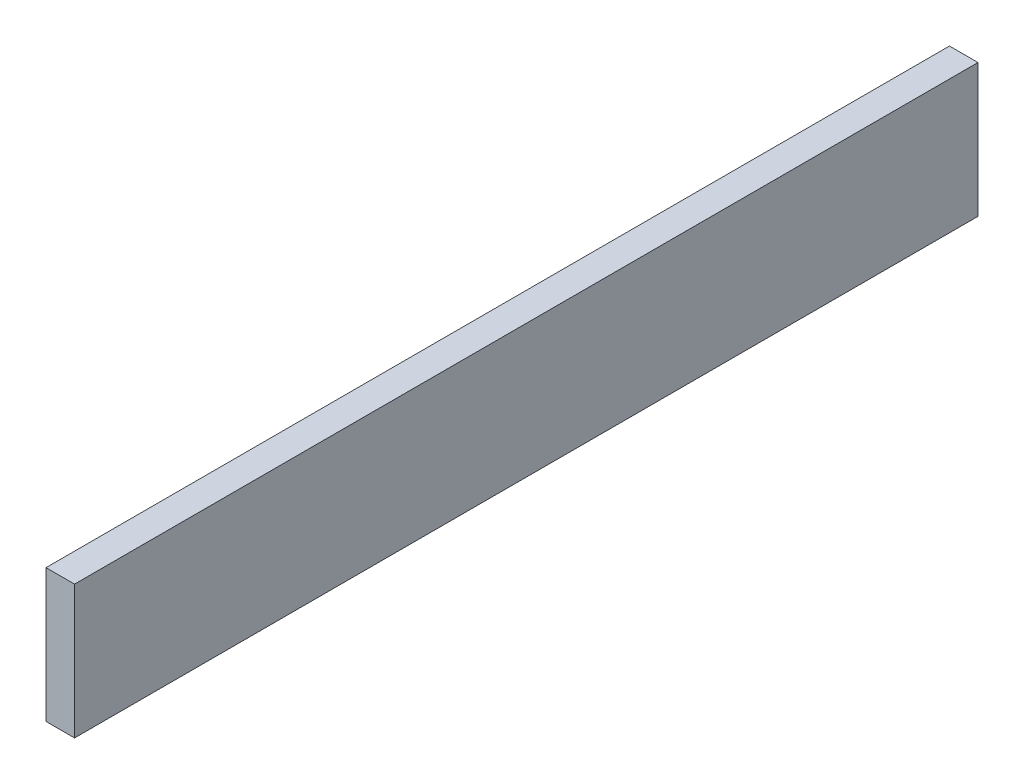
ISO-10303-21;
HEADER;
FILE_DESCRIPTION(('STEP AP214'),'2;1');
FILE_NAME('part.step','',(''),(''),'','','');
FILE_SCHEMA(('AUTOMOTIVE_DESIGN { 1 0 10303 214 1 1 1 1 }'));
ENDSEC;
DATA;
#1=APPLICATION_CONTEXT('core data for automotive mechanical design processes');
#2=APPLICATION_PROTOCOL_DEFINITION('international standard','automotive_design',2000,#1);
#3=PRODUCT_CONTEXT('',#1,'mechanical');
#4=PRODUCT('Part','Part','',(#3));
#5=PRODUCT_RELATED_PRODUCT_CATEGORY('part','',(#4));
#6=PRODUCT_DEFINITION_FORMATION('','',#4);
#7=PRODUCT_DEFINITION_CONTEXT('part definition',#1,'design');
#8=PRODUCT_DEFINITION('design','',#6,#7);
#9=PRODUCT_DEFINITION_SHAPE('','',#8);
#10=(LENGTH_UNIT() NAMED_UNIT(*) SI_UNIT(.MILLI.,.METRE.));
#11=(NAMED_UNIT(*) PLANE_ANGLE_UNIT() SI_UNIT($,.RADIAN.));
#12=(NAMED_UNIT(*) SI_UNIT($,.STERADIAN.) SOLID_ANGLE_UNIT());
#13=UNCERTAINTY_MEASURE_WITH_UNIT(LENGTH_MEASURE(1.E-05),#10,'distance_accuracy_value','');
#14=(GEOMETRIC_REPRESENTATION_CONTEXT(3) GLOBAL_UNCERTAINTY_ASSIGNED_CONTEXT((#13)) GLOBAL_UNIT_ASSIGNED_CONTEXT((#10,
#11,#12)) REPRESENTATION_CONTEXT('',''));
#15=CARTESIAN_POINT('',(0.,0.,0.));
#16=DIRECTION('',(0.,0.,1.));
#17=DIRECTION('',(1.,0.,0.));
#18=AXIS2_PLACEMENT_3D('',#15,#16,#17);
#19=CARTESIAN_POINT('',(19.05,-44.45,-301.397045256125));
#20=DIRECTION('',(0.,0.,1.));
#21=DIRECTION('',(1.,0.,0.));
#22=AXIS2_PLACEMENT_3D('',#19,#20,#21);
#23=PLANE('',#22);
#24=DIRECTION('',(0.,1.,0.));
#25=VECTOR('',#24,1.);
#26=CARTESIAN_POINT('',(0.,-44.45,-301.397045256125));
#27=LINE('',#26,#25);
#28=CARTESIAN_POINT('',(0.,-44.45,-301.397045256125));
#29=VERTEX_POINT('',#28);
#30=CARTESIAN_POINT('',(0.,44.45,-301.397045256125));
#31=VERTEX_POINT('',#30);
#32=EDGE_CURVE('E96',#29,#31,#27,.T.);
#33=ORIENTED_EDGE('',*,*,#32,.T.);
#34=DIRECTION('',(-1.,0.,0.));
#35=VECTOR('',#34,1.);
#36=CARTESIAN_POINT('',(19.05,44.45,-301.397045256125));
#37=LINE('',#36,#35);
#38=CARTESIAN_POINT('',(19.05,44.45,-301.397045256125));
#39=VERTEX_POINT('',#38);
#40=EDGE_CURVE('E11',#39,#31,#37,.T.);
#41=ORIENTED_EDGE('',*,*,#40,.F.);
#42=DIRECTION('',(0.,1.,0.));
#43=VECTOR('',#42,1.);
#44=CARTESIAN_POINT('',(19.05,-44.45,-301.397045256125));
#45=LINE('',#44,#43);
#46=CARTESIAN_POINT('',(19.05,-44.45,-301.397045256125));
#47=VERTEX_POINT('',#46);
#48=EDGE_CURVE('E84',#47,#39,#45,.T.);
#49=ORIENTED_EDGE('',*,*,#48,.F.);
#50=DIRECTION('',(-1.,0.,0.));
#51=VECTOR('',#50,1.);
#52=CARTESIAN_POINT('',(19.05,-44.45,-301.397045256125));
#53=LINE('',#52,#51);
#54=EDGE_CURVE('E92',#47,#29,#53,.T.);
#55=ORIENTED_EDGE('',*,*,#54,.T.);
#56=EDGE_LOOP('',(#33,#41,#49,#55));
#57=FACE_BOUND('',#56,.T.);
#58=ADVANCED_FACE('F33',(#57),#23,.F.);
#59=CARTESIAN_POINT('',(19.05,44.45,301.397045256125));
#60=DIRECTION('',(0.,-1.,0.));
#61=DIRECTION('',(0.,0.,-1.));
#62=AXIS2_PLACEMENT_3D('',#59,#60,#61);
#63=PLANE('',#62);
#64=DIRECTION('',(0.,0.,1.));
#65=VECTOR('',#64,1.);
#66=CARTESIAN_POINT('',(0.,44.45,301.397045256125));
#67=LINE('',#66,#65);
#68=CARTESIAN_POINT('',(0.,44.45,301.397045256125));
#69=VERTEX_POINT('',#68);
#70=EDGE_CURVE('E88',#31,#69,#67,.T.);
#71=ORIENTED_EDGE('',*,*,#70,.T.);
#72=DIRECTION('',(-1.,0.,0.));
#73=VECTOR('',#72,1.);
#74=CARTESIAN_POINT('',(19.05,44.45,301.397045256125));
#75=LINE('',#74,#73);
#76=CARTESIAN_POINT('',(19.05,44.45,301.397045256125));
#77=VERTEX_POINT('',#76);
#78=EDGE_CURVE('E41',#77,#69,#75,.T.);
#79=ORIENTED_EDGE('',*,*,#78,.F.);
#80=DIRECTION('',(0.,0.,1.));
#81=VECTOR('',#80,1.);
#82=CARTESIAN_POINT('',(19.05,44.45,301.397045256125));
#83=LINE('',#82,#81);
#84=EDGE_CURVE('E79',#39,#77,#83,.T.);
#85=ORIENTED_EDGE('',*,*,#84,.F.);
#86=ORIENTED_EDGE('',*,*,#40,.T.);
#87=EDGE_LOOP('',(#71,#79,#85,#86));
#88=FACE_BOUND('',#87,.T.);
#89=ADVANCED_FACE('F87',(#88),#63,.F.);
#90=CARTESIAN_POINT('',(19.05,-44.45,301.397045256125));
#91=DIRECTION('',(0.,0.,-1.));
#92=DIRECTION('',(-1.,0.,0.));
#93=AXIS2_PLACEMENT_3D('',#90,#91,#92);
#94=PLANE('',#93);
#95=DIRECTION('',(0.,-1.,0.));
#96=VECTOR('',#95,1.);
#97=CARTESIAN_POINT('',(0.,-44.45,301.397045256125));
#98=LINE('',#97,#96);
#99=CARTESIAN_POINT('',(0.,-44.45,301.397045256125));
#100=VERTEX_POINT('',#99);
#101=EDGE_CURVE('E66',#69,#100,#98,.T.);
#102=ORIENTED_EDGE('',*,*,#101,.T.);
#103=DIRECTION('',(-1.,0.,0.));
#104=VECTOR('',#103,1.);
#105=CARTESIAN_POINT('',(19.05,-44.45,301.397045256125));
#106=LINE('',#105,#104);
#107=CARTESIAN_POINT('',(19.05,-44.45,301.397045256125));
#108=VERTEX_POINT('',#107);
#109=EDGE_CURVE('E89',#108,#100,#106,.T.);
#110=ORIENTED_EDGE('',*,*,#109,.F.);
#111=DIRECTION('',(0.,-1.,0.));
#112=VECTOR('',#111,1.);
#113=CARTESIAN_POINT('',(19.05,-44.45,301.397045256125));
#114=LINE('',#113,#112);
#115=EDGE_CURVE('E82',#77,#108,#114,.T.);
#116=ORIENTED_EDGE('',*,*,#115,.F.);
#117=ORIENTED_EDGE('',*,*,#78,.T.);
#118=EDGE_LOOP('',(#102,#110,#116,#117));
#119=FACE_BOUND('',#118,.T.);
#120=ADVANCED_FACE('F90',(#119),#94,.F.);
#121=CARTESIAN_POINT('',(19.05,-44.45,301.397045256125));
#122=DIRECTION('',(0.,1.,0.));
#123=DIRECTION('',(0.,0.,1.));
#124=AXIS2_PLACEMENT_3D('',#121,#122,#123);
#125=PLANE('',#124);
#126=DIRECTION('',(0.,0.,-1.));
#127=VECTOR('',#126,1.);
#128=CARTESIAN_POINT('',(0.,-44.45,301.397045256125));
#129=LINE('',#128,#127);
#130=EDGE_CURVE('E72',#100,#29,#129,.T.);
#131=ORIENTED_EDGE('',*,*,#130,.T.);
#132=ORIENTED_EDGE('',*,*,#54,.F.);
#133=DIRECTION('',(0.,0.,-1.));
#134=VECTOR('',#133,1.);
#135=CARTESIAN_POINT('',(19.05,-44.45,301.397045256125));
#136=LINE('',#135,#134);
#137=EDGE_CURVE('E49',#108,#47,#136,.T.);
#138=ORIENTED_EDGE('',*,*,#137,.F.);
#139=ORIENTED_EDGE('',*,*,#109,.T.);
#140=EDGE_LOOP('',(#131,#132,#138,#139));
#141=FACE_BOUND('',#140,.T.);
#142=ADVANCED_FACE('F103',(#141),#125,.F.);
#143=CARTESIAN_POINT('',(19.05,0.,0.));
#144=DIRECTION('',(-1.,0.,0.));
#145=DIRECTION('',(0.,0.,1.));
#146=AXIS2_PLACEMENT_3D('',#143,#144,#145);
#147=PLANE('',#146);
#148=ORIENTED_EDGE('',*,*,#48,.T.);
#149=ORIENTED_EDGE('',*,*,#84,.T.);
#150=ORIENTED_EDGE('',*,*,#115,.T.);
#151=ORIENTED_EDGE('',*,*,#137,.T.);
#152=EDGE_LOOP('',(#148,#149,#150,#151));
#153=FACE_BOUND('',#152,.T.);
#154=ADVANCED_FACE('F80',(#153),#147,.F.);
#155=CARTESIAN_POINT('',(0.,0.,0.));
#156=DIRECTION('',(-1.,0.,0.));
#157=DIRECTION('',(0.,0.,1.));
#158=AXIS2_PLACEMENT_3D('',#155,#156,#157);
#159=PLANE('',#158);
#160=ORIENTED_EDGE('',*,*,#32,.F.);
#161=ORIENTED_EDGE('',*,*,#130,.F.);
#162=ORIENTED_EDGE('',*,*,#101,.F.);
#163=ORIENTED_EDGE('',*,*,#70,.F.);
#164=EDGE_LOOP('',(#160,#161,#162,#163));
#165=FACE_BOUND('',#164,.T.);
#166=ADVANCED_FACE('F106',(#165),#159,.T.);
#167=CLOSED_SHELL('',(#58,#89,#120,#142,#154,#166));
#168=MANIFOLD_SOLID_BREP('B2',#167);
#169=ADVANCED_BREP_SHAPE_REPRESENTATION('',(#18,#168),#14);
#170=SHAPE_DEFINITION_REPRESENTATION(#9,#169);
ENDSEC;
END-ISO-10303-21;
